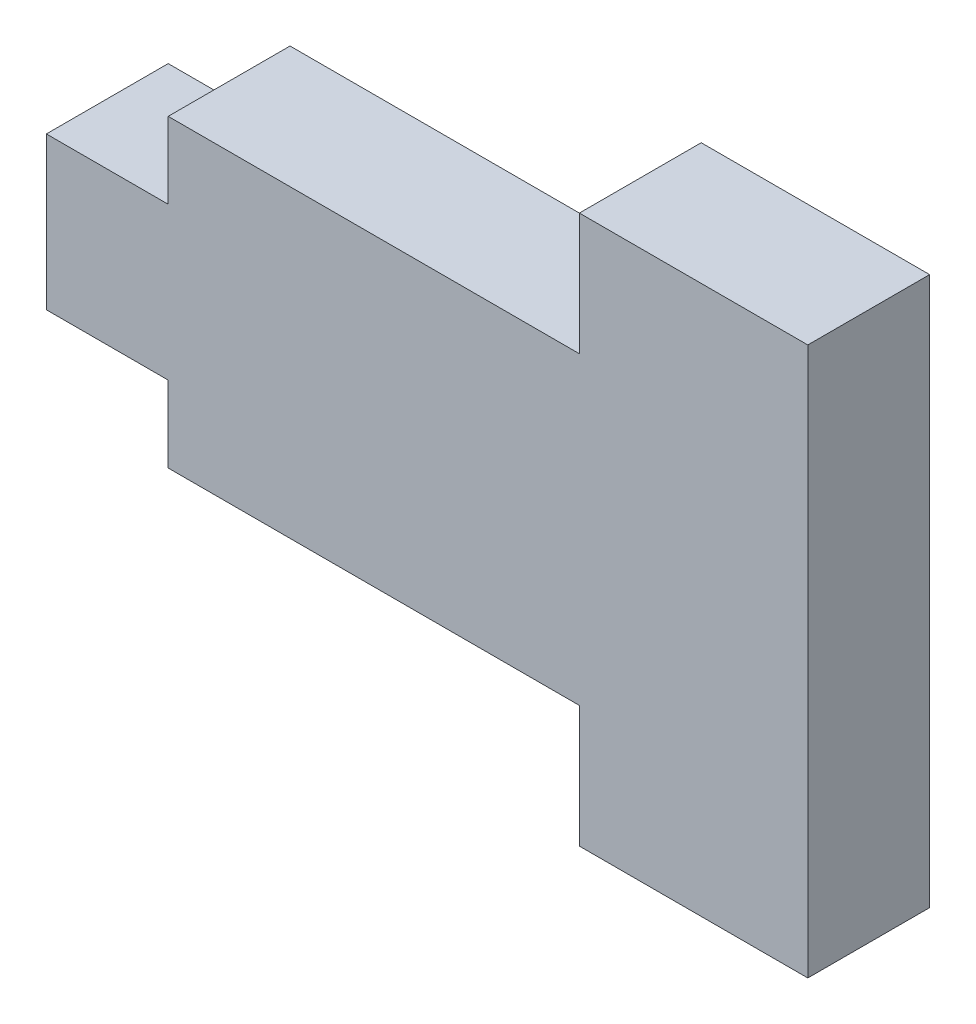
ISO-10303-21;
HEADER;
FILE_DESCRIPTION(('STEP AP214'),'2;1');
FILE_NAME('part.step','',(''),(''),'','','');
FILE_SCHEMA(('AUTOMOTIVE_DESIGN { 1 0 10303 214 1 1 1 1 }'));
ENDSEC;
DATA;
#1=APPLICATION_CONTEXT('core data for automotive mechanical design processes');
#2=APPLICATION_PROTOCOL_DEFINITION('international standard','automotive_design',2000,#1);
#3=PRODUCT_CONTEXT('',#1,'mechanical');
#4=PRODUCT('Part','Part','',(#3));
#5=PRODUCT_RELATED_PRODUCT_CATEGORY('part','',(#4));
#6=PRODUCT_DEFINITION_FORMATION('','',#4);
#7=PRODUCT_DEFINITION_CONTEXT('part definition',#1,'design');
#8=PRODUCT_DEFINITION('design','',#6,#7);
#9=PRODUCT_DEFINITION_SHAPE('','',#8);
#10=(LENGTH_UNIT() NAMED_UNIT(*) SI_UNIT(.MILLI.,.METRE.));
#11=(NAMED_UNIT(*) PLANE_ANGLE_UNIT() SI_UNIT($,.RADIAN.));
#12=(NAMED_UNIT(*) SI_UNIT($,.STERADIAN.) SOLID_ANGLE_UNIT());
#13=UNCERTAINTY_MEASURE_WITH_UNIT(LENGTH_MEASURE(1.E-05),#10,'distance_accuracy_value','');
#14=(GEOMETRIC_REPRESENTATION_CONTEXT(3) GLOBAL_UNCERTAINTY_ASSIGNED_CONTEXT((#13)) GLOBAL_UNIT_ASSIGNED_CONTEXT((#10,
#11,#12)) REPRESENTATION_CONTEXT('',''));
#15=CARTESIAN_POINT('',(0.,0.,0.));
#16=DIRECTION('',(0.,0.,1.));
#17=DIRECTION('',(1.,0.,0.));
#18=AXIS2_PLACEMENT_3D('',#15,#16,#17);
#19=CARTESIAN_POINT('',(-18.415,0.,5.08));
#20=DIRECTION('',(1.,0.,0.));
#21=DIRECTION('',(0.,1.,0.));
#22=AXIS2_PLACEMENT_3D('',#19,#20,#21);
#23=PLANE('',#22);
#24=DIRECTION('',(0.,-1.,0.));
#25=VECTOR('',#24,1.);
#26=CARTESIAN_POINT('',(-18.415,0.,0.));
#27=LINE('',#26,#25);
#28=CARTESIAN_POINT('',(-18.415,3.175,0.));
#29=VERTEX_POINT('',#28);
#30=CARTESIAN_POINT('',(-18.415,-3.175,0.));
#31=VERTEX_POINT('',#30);
#32=EDGE_CURVE('E158',#29,#31,#27,.T.);
#33=ORIENTED_EDGE('',*,*,#32,.T.);
#34=DIRECTION('',(0.,0.,-1.));
#35=VECTOR('',#34,1.);
#36=CARTESIAN_POINT('',(-18.415,-3.175,5.08));
#37=LINE('',#36,#35);
#38=CARTESIAN_POINT('',(-18.415,-3.175,5.08));
#39=VERTEX_POINT('',#38);
#40=EDGE_CURVE('E11',#39,#31,#37,.T.);
#41=ORIENTED_EDGE('',*,*,#40,.F.);
#42=DIRECTION('',(0.,-1.,0.));
#43=VECTOR('',#42,1.);
#44=CARTESIAN_POINT('',(-18.415,0.,5.08));
#45=LINE('',#44,#43);
#46=CARTESIAN_POINT('',(-18.415,3.175,5.08));
#47=VERTEX_POINT('',#46);
#48=EDGE_CURVE('E186',#47,#39,#45,.T.);
#49=ORIENTED_EDGE('',*,*,#48,.F.);
#50=DIRECTION('',(0.,0.,-1.));
#51=VECTOR('',#50,1.);
#52=CARTESIAN_POINT('',(-18.415,3.175,5.08));
#53=LINE('',#52,#51);
#54=EDGE_CURVE('E51',#47,#29,#53,.T.);
#55=ORIENTED_EDGE('',*,*,#54,.T.);
#56=EDGE_LOOP('',(#33,#41,#49,#55));
#57=FACE_BOUND('',#56,.T.);
#58=ADVANCED_FACE('F35',(#57),#23,.F.);
#59=CARTESIAN_POINT('',(0.,-3.175,5.08));
#60=DIRECTION('',(0.,1.,0.));
#61=DIRECTION('',(0.,0.,1.));
#62=AXIS2_PLACEMENT_3D('',#59,#60,#61);
#63=PLANE('',#62);
#64=DIRECTION('',(1.,0.,0.));
#65=VECTOR('',#64,1.);
#66=CARTESIAN_POINT('',(0.,-3.175,0.));
#67=LINE('',#66,#65);
#68=CARTESIAN_POINT('',(-13.335,-3.175,0.));
#69=VERTEX_POINT('',#68);
#70=EDGE_CURVE('E160',#31,#69,#67,.T.);
#71=ORIENTED_EDGE('',*,*,#70,.T.);
#72=DIRECTION('',(0.,0.,-1.));
#73=VECTOR('',#72,1.);
#74=CARTESIAN_POINT('',(-13.335,-3.175,5.08));
#75=LINE('',#74,#73);
#76=CARTESIAN_POINT('',(-13.335,-3.175,5.08));
#77=VERTEX_POINT('',#76);
#78=EDGE_CURVE('E43',#77,#69,#75,.T.);
#79=ORIENTED_EDGE('',*,*,#78,.F.);
#80=DIRECTION('',(1.,0.,0.));
#81=VECTOR('',#80,1.);
#82=CARTESIAN_POINT('',(0.,-3.175,5.08));
#83=LINE('',#82,#81);
#84=EDGE_CURVE('E102',#39,#77,#83,.T.);
#85=ORIENTED_EDGE('',*,*,#84,.F.);
#86=ORIENTED_EDGE('',*,*,#40,.T.);
#87=EDGE_LOOP('',(#71,#79,#85,#86));
#88=FACE_BOUND('',#87,.T.);
#89=ADVANCED_FACE('F252',(#88),#63,.F.);
#90=CARTESIAN_POINT('',(-13.335,0.,5.08));
#91=DIRECTION('',(1.,0.,0.));
#92=DIRECTION('',(0.,0.,-1.));
#93=AXIS2_PLACEMENT_3D('',#90,#91,#92);
#94=PLANE('',#93);
#95=DIRECTION('',(0.,-1.,0.));
#96=VECTOR('',#95,1.);
#97=CARTESIAN_POINT('',(-13.335,0.,0.));
#98=LINE('',#97,#96);
#99=CARTESIAN_POINT('',(-13.335,-6.35,0.));
#100=VERTEX_POINT('',#99);
#101=EDGE_CURVE('E162',#69,#100,#98,.T.);
#102=ORIENTED_EDGE('',*,*,#101,.T.);
#103=DIRECTION('',(0.,0.,-1.));
#104=VECTOR('',#103,1.);
#105=CARTESIAN_POINT('',(-13.335,-6.35,5.08));
#106=LINE('',#105,#104);
#107=CARTESIAN_POINT('',(-13.335,-6.35,5.08));
#108=VERTEX_POINT('',#107);
#109=EDGE_CURVE('E201',#108,#100,#106,.T.);
#110=ORIENTED_EDGE('',*,*,#109,.F.);
#111=DIRECTION('',(0.,-1.,0.));
#112=VECTOR('',#111,1.);
#113=CARTESIAN_POINT('',(-13.335,0.,5.08));
#114=LINE('',#113,#112);
#115=EDGE_CURVE('E147',#77,#108,#114,.T.);
#116=ORIENTED_EDGE('',*,*,#115,.F.);
#117=ORIENTED_EDGE('',*,*,#78,.T.);
#118=EDGE_LOOP('',(#102,#110,#116,#117));
#119=FACE_BOUND('',#118,.T.);
#120=ADVANCED_FACE('F207',(#119),#94,.F.);
#121=CARTESIAN_POINT('',(0.,-6.35,5.08));
#122=DIRECTION('',(0.,1.,0.));
#123=DIRECTION('',(0.,0.,1.));
#124=AXIS2_PLACEMENT_3D('',#121,#122,#123);
#125=PLANE('',#124);
#126=DIRECTION('',(1.,0.,0.));
#127=VECTOR('',#126,1.);
#128=CARTESIAN_POINT('',(0.,-6.35,0.));
#129=LINE('',#128,#127);
#130=CARTESIAN_POINT('',(3.81,-6.35,0.));
#131=VERTEX_POINT('',#130);
#132=EDGE_CURVE('E164',#100,#131,#129,.T.);
#133=ORIENTED_EDGE('',*,*,#132,.T.);
#134=DIRECTION('',(0.,0.,-1.));
#135=VECTOR('',#134,1.);
#136=CARTESIAN_POINT('',(3.81,-6.35,5.08));
#137=LINE('',#136,#135);
#138=CARTESIAN_POINT('',(3.81,-6.35,5.08));
#139=VERTEX_POINT('',#138);
#140=EDGE_CURVE('E198',#139,#131,#137,.T.);
#141=ORIENTED_EDGE('',*,*,#140,.F.);
#142=DIRECTION('',(1.,0.,0.));
#143=VECTOR('',#142,1.);
#144=CARTESIAN_POINT('',(0.,-6.35,5.08));
#145=LINE('',#144,#143);
#146=EDGE_CURVE('E225',#108,#139,#145,.T.);
#147=ORIENTED_EDGE('',*,*,#146,.F.);
#148=ORIENTED_EDGE('',*,*,#109,.T.);
#149=EDGE_LOOP('',(#133,#141,#147,#148));
#150=FACE_BOUND('',#149,.T.);
#151=ADVANCED_FACE('F215',(#150),#125,.F.);
#152=CARTESIAN_POINT('',(3.81,0.,5.08));
#153=DIRECTION('',(1.,0.,0.));
#154=DIRECTION('',(0.,0.,-1.));
#155=AXIS2_PLACEMENT_3D('',#152,#153,#154);
#156=PLANE('',#155);
#157=DIRECTION('',(0.,-1.,0.));
#158=VECTOR('',#157,1.);
#159=CARTESIAN_POINT('',(3.81,0.,0.));
#160=LINE('',#159,#158);
#161=CARTESIAN_POINT('',(3.81,-11.43,0.));
#162=VERTEX_POINT('',#161);
#163=EDGE_CURVE('E167',#131,#162,#160,.T.);
#164=ORIENTED_EDGE('',*,*,#163,.T.);
#165=DIRECTION('',(0.,0.,-1.));
#166=VECTOR('',#165,1.);
#167=CARTESIAN_POINT('',(3.81,-11.43,5.08));
#168=LINE('',#167,#166);
#169=CARTESIAN_POINT('',(3.81,-11.43,5.08));
#170=VERTEX_POINT('',#169);
#171=EDGE_CURVE('E196',#170,#162,#168,.T.);
#172=ORIENTED_EDGE('',*,*,#171,.F.);
#173=DIRECTION('',(0.,-1.,0.));
#174=VECTOR('',#173,1.);
#175=CARTESIAN_POINT('',(3.81,0.,5.08));
#176=LINE('',#175,#174);
#177=EDGE_CURVE('E221',#139,#170,#176,.T.);
#178=ORIENTED_EDGE('',*,*,#177,.F.);
#179=ORIENTED_EDGE('',*,*,#140,.T.);
#180=EDGE_LOOP('',(#164,#172,#178,#179));
#181=FACE_BOUND('',#180,.T.);
#182=ADVANCED_FACE('F219',(#181),#156,.F.);
#183=CARTESIAN_POINT('',(0.,-11.43,5.08));
#184=DIRECTION('',(0.,-1.,0.));
#185=DIRECTION('',(1.,0.,0.));
#186=AXIS2_PLACEMENT_3D('',#183,#184,#185);
#187=PLANE('',#186);
#188=DIRECTION('',(-1.,0.,0.));
#189=VECTOR('',#188,1.);
#190=CARTESIAN_POINT('',(0.,-11.43,0.));
#191=LINE('',#190,#189);
#192=CARTESIAN_POINT('',(13.335,-11.43,0.));
#193=VERTEX_POINT('',#192);
#194=EDGE_CURVE('E170',#193,#162,#191,.T.);
#195=ORIENTED_EDGE('',*,*,#194,.F.);
#196=DIRECTION('',(0.,0.,-1.));
#197=VECTOR('',#196,1.);
#198=CARTESIAN_POINT('',(13.335,-11.43,5.08));
#199=LINE('',#198,#197);
#200=CARTESIAN_POINT('',(13.335,-11.43,5.08));
#201=VERTEX_POINT('',#200);
#202=EDGE_CURVE('E194',#201,#193,#199,.T.);
#203=ORIENTED_EDGE('',*,*,#202,.F.);
#204=DIRECTION('',(-1.,0.,0.));
#205=VECTOR('',#204,1.);
#206=CARTESIAN_POINT('',(0.,-11.43,5.08));
#207=LINE('',#206,#205);
#208=EDGE_CURVE('E224',#201,#170,#207,.T.);
#209=ORIENTED_EDGE('',*,*,#208,.T.);
#210=ORIENTED_EDGE('',*,*,#171,.T.);
#211=EDGE_LOOP('',(#195,#203,#209,#210));
#212=FACE_BOUND('',#211,.T.);
#213=ADVANCED_FACE('F267',(#212),#187,.T.);
#214=CARTESIAN_POINT('',(13.335,0.,5.08));
#215=DIRECTION('',(1.,0.,0.));
#216=DIRECTION('',(0.,0.,-1.));
#217=AXIS2_PLACEMENT_3D('',#214,#215,#216);
#218=PLANE('',#217);
#219=DIRECTION('',(0.,-1.,0.));
#220=VECTOR('',#219,1.);
#221=CARTESIAN_POINT('',(13.335,0.,0.));
#222=LINE('',#221,#220);
#223=CARTESIAN_POINT('',(13.335,11.43,0.));
#224=VERTEX_POINT('',#223);
#225=EDGE_CURVE('E173',#224,#193,#222,.T.);
#226=ORIENTED_EDGE('',*,*,#225,.F.);
#227=DIRECTION('',(0.,0.,-1.));
#228=VECTOR('',#227,1.);
#229=CARTESIAN_POINT('',(13.335,11.43,5.08));
#230=LINE('',#229,#228);
#231=CARTESIAN_POINT('',(13.335,11.43,5.08));
#232=VERTEX_POINT('',#231);
#233=EDGE_CURVE('E192',#232,#224,#230,.T.);
#234=ORIENTED_EDGE('',*,*,#233,.F.);
#235=DIRECTION('',(0.,-1.,0.));
#236=VECTOR('',#235,1.);
#237=CARTESIAN_POINT('',(13.335,0.,5.08));
#238=LINE('',#237,#236);
#239=EDGE_CURVE('E227',#232,#201,#238,.T.);
#240=ORIENTED_EDGE('',*,*,#239,.T.);
#241=ORIENTED_EDGE('',*,*,#202,.T.);
#242=EDGE_LOOP('',(#226,#234,#240,#241));
#243=FACE_BOUND('',#242,.T.);
#244=ADVANCED_FACE('F270',(#243),#218,.T.);
#245=CARTESIAN_POINT('',(0.,11.43,5.08));
#246=DIRECTION('',(0.,-1.,0.));
#247=DIRECTION('',(1.,0.,0.));
#248=AXIS2_PLACEMENT_3D('',#245,#246,#247);
#249=PLANE('',#248);
#250=DIRECTION('',(-1.,0.,0.));
#251=VECTOR('',#250,1.);
#252=CARTESIAN_POINT('',(0.,11.43,0.));
#253=LINE('',#252,#251);
#254=CARTESIAN_POINT('',(3.81,11.43,0.));
#255=VERTEX_POINT('',#254);
#256=EDGE_CURVE('E176',#224,#255,#253,.T.);
#257=ORIENTED_EDGE('',*,*,#256,.T.);
#258=DIRECTION('',(0.,0.,-1.));
#259=VECTOR('',#258,1.);
#260=CARTESIAN_POINT('',(3.81,11.43,5.08));
#261=LINE('',#260,#259);
#262=CARTESIAN_POINT('',(3.81,11.43,5.08));
#263=VERTEX_POINT('',#262);
#264=EDGE_CURVE('E190',#263,#255,#261,.T.);
#265=ORIENTED_EDGE('',*,*,#264,.F.);
#266=DIRECTION('',(-1.,0.,0.));
#267=VECTOR('',#266,1.);
#268=CARTESIAN_POINT('',(0.,11.43,5.08));
#269=LINE('',#268,#267);
#270=EDGE_CURVE('E153',#232,#263,#269,.T.);
#271=ORIENTED_EDGE('',*,*,#270,.F.);
#272=ORIENTED_EDGE('',*,*,#233,.T.);
#273=EDGE_LOOP('',(#257,#265,#271,#272));
#274=FACE_BOUND('',#273,.T.);
#275=ADVANCED_FACE('F236',(#274),#249,.F.);
#276=CARTESIAN_POINT('',(3.81,0.,5.08));
#277=DIRECTION('',(-1.,0.,0.));
#278=DIRECTION('',(0.,0.,1.));
#279=AXIS2_PLACEMENT_3D('',#276,#277,#278);
#280=PLANE('',#279);
#281=DIRECTION('',(0.,1.,0.));
#282=VECTOR('',#281,1.);
#283=CARTESIAN_POINT('',(3.81,0.,0.));
#284=LINE('',#283,#282);
#285=CARTESIAN_POINT('',(3.81,6.35,0.));
#286=VERTEX_POINT('',#285);
#287=EDGE_CURVE('E179',#286,#255,#284,.T.);
#288=ORIENTED_EDGE('',*,*,#287,.F.);
#289=DIRECTION('',(0.,0.,-1.));
#290=VECTOR('',#289,1.);
#291=CARTESIAN_POINT('',(3.81,6.35,5.08));
#292=LINE('',#291,#290);
#293=CARTESIAN_POINT('',(3.81,6.35,5.08));
#294=VERTEX_POINT('',#293);
#295=EDGE_CURVE('E139',#294,#286,#292,.T.);
#296=ORIENTED_EDGE('',*,*,#295,.F.);
#297=DIRECTION('',(0.,1.,0.));
#298=VECTOR('',#297,1.);
#299=CARTESIAN_POINT('',(3.81,0.,5.08));
#300=LINE('',#299,#298);
#301=EDGE_CURVE('E151',#294,#263,#300,.T.);
#302=ORIENTED_EDGE('',*,*,#301,.T.);
#303=ORIENTED_EDGE('',*,*,#264,.T.);
#304=EDGE_LOOP('',(#288,#296,#302,#303));
#305=FACE_BOUND('',#304,.T.);
#306=ADVANCED_FACE('F240',(#305),#280,.T.);
#307=CARTESIAN_POINT('',(0.,6.35,5.08));
#308=DIRECTION('',(0.,1.,0.));
#309=DIRECTION('',(0.,0.,1.));
#310=AXIS2_PLACEMENT_3D('',#307,#308,#309);
#311=PLANE('',#310);
#312=DIRECTION('',(1.,0.,0.));
#313=VECTOR('',#312,1.);
#314=CARTESIAN_POINT('',(0.,6.35,0.));
#315=LINE('',#314,#313);
#316=CARTESIAN_POINT('',(-13.335,6.35,0.));
#317=VERTEX_POINT('',#316);
#318=EDGE_CURVE('E136',#317,#286,#315,.T.);
#319=ORIENTED_EDGE('',*,*,#318,.F.);
#320=DIRECTION('',(0.,0.,-1.));
#321=VECTOR('',#320,1.);
#322=CARTESIAN_POINT('',(-13.335,6.35,5.08));
#323=LINE('',#322,#321);
#324=CARTESIAN_POINT('',(-13.335,6.35,5.08));
#325=VERTEX_POINT('',#324);
#326=EDGE_CURVE('E130',#325,#317,#323,.T.);
#327=ORIENTED_EDGE('',*,*,#326,.F.);
#328=DIRECTION('',(1.,0.,0.));
#329=VECTOR('',#328,1.);
#330=CARTESIAN_POINT('',(0.,6.35,5.08));
#331=LINE('',#330,#329);
#332=EDGE_CURVE('E134',#325,#294,#331,.T.);
#333=ORIENTED_EDGE('',*,*,#332,.T.);
#334=ORIENTED_EDGE('',*,*,#295,.T.);
#335=EDGE_LOOP('',(#319,#327,#333,#334));
#336=FACE_BOUND('',#335,.T.);
#337=ADVANCED_FACE('F132',(#336),#311,.T.);
#338=CARTESIAN_POINT('',(-13.335,3.175,0.));
#339=VERTEX_POINT('',#338);
#340=EDGE_CURVE('E165',#317,#339,#98,.T.);
#341=ORIENTED_EDGE('',*,*,#340,.T.);
#342=DIRECTION('',(0.,0.,-1.));
#343=VECTOR('',#342,1.);
#344=CARTESIAN_POINT('',(-13.335,3.175,5.08));
#345=LINE('',#344,#343);
#346=CARTESIAN_POINT('',(-13.335,3.175,5.08));
#347=VERTEX_POINT('',#346);
#348=EDGE_CURVE('E90',#347,#339,#345,.T.);
#349=ORIENTED_EDGE('',*,*,#348,.F.);
#350=EDGE_CURVE('E141',#325,#347,#114,.T.);
#351=ORIENTED_EDGE('',*,*,#350,.F.);
#352=ORIENTED_EDGE('',*,*,#326,.T.);
#353=EDGE_LOOP('',(#341,#349,#351,#352));
#354=FACE_BOUND('',#353,.T.);
#355=ADVANCED_FACE('F142',(#354),#94,.F.);
#356=CARTESIAN_POINT('',(0.,3.175,5.08));
#357=DIRECTION('',(0.,1.,0.));
#358=DIRECTION('',(0.,0.,1.));
#359=AXIS2_PLACEMENT_3D('',#356,#357,#358);
#360=PLANE('',#359);
#361=DIRECTION('',(1.,0.,0.));
#362=VECTOR('',#361,1.);
#363=CARTESIAN_POINT('',(0.,3.175,0.));
#364=LINE('',#363,#362);
#365=EDGE_CURVE('E183',#29,#339,#364,.T.);
#366=ORIENTED_EDGE('',*,*,#365,.F.);
#367=ORIENTED_EDGE('',*,*,#54,.F.);
#368=DIRECTION('',(1.,0.,0.));
#369=VECTOR('',#368,1.);
#370=CARTESIAN_POINT('',(0.,3.175,5.08));
#371=LINE('',#370,#369);
#372=EDGE_CURVE('E145',#47,#347,#371,.T.);
#373=ORIENTED_EDGE('',*,*,#372,.T.);
#374=ORIENTED_EDGE('',*,*,#348,.T.);
#375=EDGE_LOOP('',(#366,#367,#373,#374));
#376=FACE_BOUND('',#375,.T.);
#377=ADVANCED_FACE('F241',(#376),#360,.T.);
#378=CARTESIAN_POINT('',(0.,0.,5.08));
#379=DIRECTION('',(0.,0.,1.));
#380=DIRECTION('',(1.,0.,0.));
#381=AXIS2_PLACEMENT_3D('',#378,#379,#380);
#382=PLANE('',#381);
#383=ORIENTED_EDGE('',*,*,#48,.T.);
#384=ORIENTED_EDGE('',*,*,#84,.T.);
#385=ORIENTED_EDGE('',*,*,#115,.T.);
#386=ORIENTED_EDGE('',*,*,#146,.T.);
#387=ORIENTED_EDGE('',*,*,#177,.T.);
#388=ORIENTED_EDGE('',*,*,#208,.F.);
#389=ORIENTED_EDGE('',*,*,#239,.F.);
#390=ORIENTED_EDGE('',*,*,#270,.T.);
#391=ORIENTED_EDGE('',*,*,#301,.F.);
#392=ORIENTED_EDGE('',*,*,#332,.F.);
#393=ORIENTED_EDGE('',*,*,#350,.T.);
#394=ORIENTED_EDGE('',*,*,#372,.F.);
#395=EDGE_LOOP('',(#383,#384,#385,#386,#387,#388,#389,#390,#391,#392,#393,#394));
#396=FACE_BOUND('',#395,.T.);
#397=ADVANCED_FACE('F149',(#396),#382,.T.);
#398=CARTESIAN_POINT('',(0.,0.,0.));
#399=DIRECTION('',(0.,0.,1.));
#400=DIRECTION('',(1.,0.,0.));
#401=AXIS2_PLACEMENT_3D('',#398,#399,#400);
#402=PLANE('',#401);
#403=ORIENTED_EDGE('',*,*,#32,.F.);
#404=ORIENTED_EDGE('',*,*,#365,.T.);
#405=ORIENTED_EDGE('',*,*,#340,.F.);
#406=ORIENTED_EDGE('',*,*,#318,.T.);
#407=ORIENTED_EDGE('',*,*,#287,.T.);
#408=ORIENTED_EDGE('',*,*,#256,.F.);
#409=ORIENTED_EDGE('',*,*,#225,.T.);
#410=ORIENTED_EDGE('',*,*,#194,.T.);
#411=ORIENTED_EDGE('',*,*,#163,.F.);
#412=ORIENTED_EDGE('',*,*,#132,.F.);
#413=ORIENTED_EDGE('',*,*,#101,.F.);
#414=ORIENTED_EDGE('',*,*,#70,.F.);
#415=EDGE_LOOP('',(#403,#404,#405,#406,#407,#408,#409,#410,#411,#412,#413,#414));
#416=FACE_BOUND('',#415,.T.);
#417=ADVANCED_FACE('F211',(#416),#402,.F.);
#418=CLOSED_SHELL('',(#58,#89,#120,#151,#182,#213,#244,#275,#306,#337,#355,#377,#397,#417));
#419=MANIFOLD_SOLID_BREP('B2',#418);
#420=ADVANCED_BREP_SHAPE_REPRESENTATION('',(#18,#419),#14);
#421=SHAPE_DEFINITION_REPRESENTATION(#9,#420);
ENDSEC;
END-ISO-10303-21;
